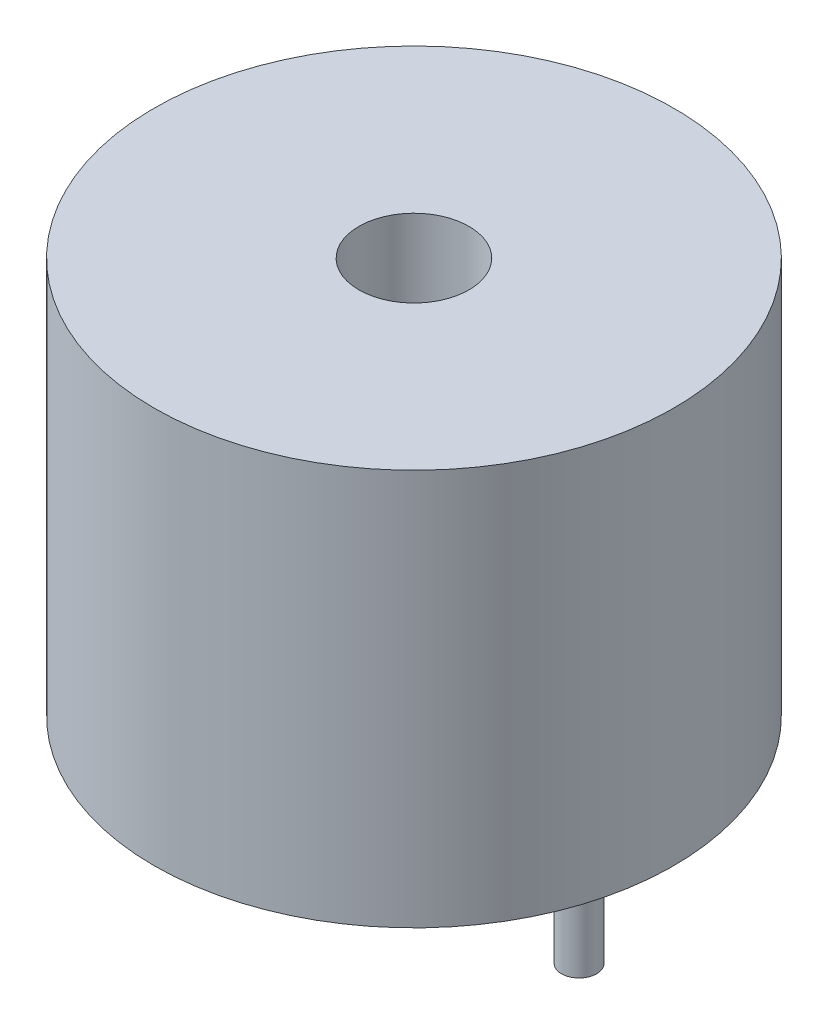
ISO-10303-21;
HEADER;
FILE_DESCRIPTION(('STEP AP214'),'2;1');
FILE_NAME('part.step','',(''),(''),'','','');
FILE_SCHEMA(('AUTOMOTIVE_DESIGN { 1 0 10303 214 1 1 1 1 }'));
ENDSEC;
DATA;
#1=APPLICATION_CONTEXT('core data for automotive mechanical design processes');
#2=APPLICATION_PROTOCOL_DEFINITION('international standard','automotive_design',2000,#1);
#3=PRODUCT_CONTEXT('',#1,'mechanical');
#4=PRODUCT('Part','Part','',(#3));
#5=PRODUCT_RELATED_PRODUCT_CATEGORY('part','',(#4));
#6=PRODUCT_DEFINITION_FORMATION('','',#4);
#7=PRODUCT_DEFINITION_CONTEXT('part definition',#1,'design');
#8=PRODUCT_DEFINITION('design','',#6,#7);
#9=PRODUCT_DEFINITION_SHAPE('','',#8);
#10=(LENGTH_UNIT() NAMED_UNIT(*) SI_UNIT(.MILLI.,.METRE.));
#11=(NAMED_UNIT(*) PLANE_ANGLE_UNIT() SI_UNIT($,.RADIAN.));
#12=(NAMED_UNIT(*) SI_UNIT($,.STERADIAN.) SOLID_ANGLE_UNIT());
#13=UNCERTAINTY_MEASURE_WITH_UNIT(LENGTH_MEASURE(1.E-05),#10,'distance_accuracy_value','');
#14=(GEOMETRIC_REPRESENTATION_CONTEXT(3) GLOBAL_UNCERTAINTY_ASSIGNED_CONTEXT((#13)) GLOBAL_UNIT_ASSIGNED_CONTEXT((#10,
#11,#12)) REPRESENTATION_CONTEXT('',''));
#15=CARTESIAN_POINT('',(0.,0.,0.));
#16=DIRECTION('',(0.,0.,1.));
#17=DIRECTION('',(1.,0.,0.));
#18=AXIS2_PLACEMENT_3D('',#15,#16,#17);
#19=CARTESIAN_POINT('',(0.,9.,0.));
#20=DIRECTION('',(0.,-1.,0.));
#21=DIRECTION('',(0.,0.,-1.));
#22=AXIS2_PLACEMENT_3D('',#19,#20,#21);
#23=CYLINDRICAL_SURFACE('',#22,5.9);
#24=CARTESIAN_POINT('',(0.,9.,0.));
#25=DIRECTION('',(0.,1.,0.));
#26=DIRECTION('',(0.,0.,1.));
#27=AXIS2_PLACEMENT_3D('',#24,#25,#26);
#28=CIRCLE('',#27,5.9);
#29=CARTESIAN_POINT('',(0.,9.,5.9));
#30=VERTEX_POINT('',#29);
#31=EDGE_CURVE('E44',#30,#30,#28,.T.);
#32=ORIENTED_EDGE('',*,*,#31,.F.);
#33=EDGE_LOOP('',(#32));
#34=FACE_BOUND('',#33,.T.);
#35=CARTESIAN_POINT('',(0.,0.,0.));
#36=DIRECTION('',(0.,1.,0.));
#37=DIRECTION('',(0.,0.,1.));
#38=AXIS2_PLACEMENT_3D('',#35,#36,#37);
#39=CIRCLE('',#38,5.9);
#40=CARTESIAN_POINT('',(0.,0.,5.9));
#41=VERTEX_POINT('',#40);
#42=EDGE_CURVE('E48',#41,#41,#39,.T.);
#43=ORIENTED_EDGE('',*,*,#42,.T.);
#44=EDGE_LOOP('',(#43));
#45=FACE_BOUND('',#44,.T.);
#46=ADVANCED_FACE('F34',(#34,#45),#23,.T.);
#47=CARTESIAN_POINT('',(0.,9.,0.));
#48=DIRECTION('',(0.,1.,0.));
#49=DIRECTION('',(0.,0.,1.));
#50=AXIS2_PLACEMENT_3D('',#47,#48,#49);
#51=PLANE('',#50);
#52=CARTESIAN_POINT('',(0.,9.,0.));
#53=DIRECTION('',(0.,1.,0.));
#54=DIRECTION('',(0.,0.,1.));
#55=AXIS2_PLACEMENT_3D('',#52,#53,#54);
#56=CIRCLE('',#55,1.25);
#57=CARTESIAN_POINT('',(0.,9.,1.25));
#58=VERTEX_POINT('',#57);
#59=EDGE_CURVE('E54',#58,#58,#56,.T.);
#60=ORIENTED_EDGE('',*,*,#59,.F.);
#61=EDGE_LOOP('',(#60));
#62=FACE_BOUND('',#61,.T.);
#63=ORIENTED_EDGE('',*,*,#31,.T.);
#64=EDGE_LOOP('',(#63));
#65=FACE_BOUND('',#64,.T.);
#66=ADVANCED_FACE('F81',(#62,#65),#51,.T.);
#67=CARTESIAN_POINT('',(0.,0.,0.));
#68=DIRECTION('',(0.,1.,0.));
#69=DIRECTION('',(0.,0.,1.));
#70=AXIS2_PLACEMENT_3D('',#67,#68,#69);
#71=PLANE('',#70);
#72=CARTESIAN_POINT('',(-3.75,0.,0.));
#73=DIRECTION('',(0.,1.,0.));
#74=DIRECTION('',(0.,0.,1.));
#75=AXIS2_PLACEMENT_3D('',#72,#73,#74);
#76=CIRCLE('',#75,0.4);
#77=CARTESIAN_POINT('',(-3.75,0.,0.4));
#78=VERTEX_POINT('',#77);
#79=EDGE_CURVE('E10',#78,#78,#76,.F.);
#80=ORIENTED_EDGE('',*,*,#79,.F.);
#81=EDGE_LOOP('',(#80));
#82=FACE_BOUND('',#81,.T.);
#83=CARTESIAN_POINT('',(3.75,0.,0.));
#84=DIRECTION('',(0.,1.,0.));
#85=DIRECTION('',(0.,0.,1.));
#86=AXIS2_PLACEMENT_3D('',#83,#84,#85);
#87=CIRCLE('',#86,0.4);
#88=CARTESIAN_POINT('',(3.75,0.,0.400000000000002));
#89=VERTEX_POINT('',#88);
#90=EDGE_CURVE('E40',#89,#89,#87,.F.);
#91=ORIENTED_EDGE('',*,*,#90,.F.);
#92=EDGE_LOOP('',(#91));
#93=FACE_BOUND('',#92,.T.);
#94=ORIENTED_EDGE('',*,*,#42,.F.);
#95=EDGE_LOOP('',(#94));
#96=FACE_BOUND('',#95,.T.);
#97=ADVANCED_FACE('F86',(#82,#93,#96),#71,.F.);
#98=CARTESIAN_POINT('',(0.,6.,0.));
#99=DIRECTION('',(0.,1.,0.));
#100=DIRECTION('',(0.,0.,1.));
#101=AXIS2_PLACEMENT_3D('',#98,#99,#100);
#102=CYLINDRICAL_SURFACE('',#101,1.25);
#103=CARTESIAN_POINT('',(0.,6.,0.));
#104=DIRECTION('',(0.,1.,0.));
#105=DIRECTION('',(0.,0.,1.));
#106=AXIS2_PLACEMENT_3D('',#103,#104,#105);
#107=CIRCLE('',#106,1.25);
#108=CARTESIAN_POINT('',(0.,6.,1.25));
#109=VERTEX_POINT('',#108);
#110=EDGE_CURVE('E52',#109,#109,#107,.T.);
#111=ORIENTED_EDGE('',*,*,#110,.F.);
#112=EDGE_LOOP('',(#111));
#113=FACE_BOUND('',#112,.T.);
#114=ORIENTED_EDGE('',*,*,#59,.T.);
#115=EDGE_LOOP('',(#114));
#116=FACE_BOUND('',#115,.T.);
#117=ADVANCED_FACE('F94',(#113,#116),#102,.F.);
#118=CARTESIAN_POINT('',(0.,6.,0.));
#119=DIRECTION('',(0.,1.,0.));
#120=DIRECTION('',(0.,0.,1.));
#121=AXIS2_PLACEMENT_3D('',#118,#119,#120);
#122=PLANE('',#121);
#123=ORIENTED_EDGE('',*,*,#110,.T.);
#124=EDGE_LOOP('',(#123));
#125=FACE_BOUND('',#124,.T.);
#126=ADVANCED_FACE('F99',(#125),#122,.T.);
#127=CARTESIAN_POINT('',(3.75,-3.,0.));
#128=DIRECTION('',(0.,1.,0.));
#129=DIRECTION('',(0.,0.,1.));
#130=AXIS2_PLACEMENT_3D('',#127,#128,#129);
#131=CYLINDRICAL_SURFACE('',#130,0.4);
#132=CARTESIAN_POINT('',(3.75,-3.,0.));
#133=DIRECTION('',(0.,-1.,0.));
#134=DIRECTION('',(0.,0.,-1.));
#135=AXIS2_PLACEMENT_3D('',#132,#133,#134);
#136=CIRCLE('',#135,0.4);
#137=CARTESIAN_POINT('',(3.75,-3.,-0.399999999999999));
#138=VERTEX_POINT('',#137);
#139=EDGE_CURVE('E57',#138,#138,#136,.T.);
#140=ORIENTED_EDGE('',*,*,#139,.F.);
#141=EDGE_LOOP('',(#140));
#142=FACE_BOUND('',#141,.T.);
#143=ORIENTED_EDGE('',*,*,#90,.T.);
#144=EDGE_LOOP('',(#143));
#145=FACE_BOUND('',#144,.T.);
#146=ADVANCED_FACE('F77',(#142,#145),#131,.T.);
#147=CARTESIAN_POINT('',(3.75,-3.,0.));
#148=DIRECTION('',(0.,-1.,0.));
#149=DIRECTION('',(0.,0.,-1.));
#150=AXIS2_PLACEMENT_3D('',#147,#148,#149);
#151=PLANE('',#150);
#152=ORIENTED_EDGE('',*,*,#139,.T.);
#153=EDGE_LOOP('',(#152));
#154=FACE_BOUND('',#153,.T.);
#155=ADVANCED_FACE('F70',(#154),#151,.T.);
#156=CARTESIAN_POINT('',(-3.75,-3.,0.));
#157=DIRECTION('',(0.,1.,0.));
#158=DIRECTION('',(0.,0.,1.));
#159=AXIS2_PLACEMENT_3D('',#156,#157,#158);
#160=CYLINDRICAL_SURFACE('',#159,0.4);
#161=CARTESIAN_POINT('',(-3.75,-3.,0.));
#162=DIRECTION('',(0.,-1.,0.));
#163=DIRECTION('',(0.,0.,-1.));
#164=AXIS2_PLACEMENT_3D('',#161,#162,#163);
#165=CIRCLE('',#164,0.4);
#166=CARTESIAN_POINT('',(-3.75,-3.,-0.4));
#167=VERTEX_POINT('',#166);
#168=EDGE_CURVE('E62',#167,#167,#165,.T.);
#169=ORIENTED_EDGE('',*,*,#168,.F.);
#170=EDGE_LOOP('',(#169));
#171=FACE_BOUND('',#170,.T.);
#172=ORIENTED_EDGE('',*,*,#79,.T.);
#173=EDGE_LOOP('',(#172));
#174=FACE_BOUND('',#173,.T.);
#175=ADVANCED_FACE('F68',(#171,#174),#160,.T.);
#176=CARTESIAN_POINT('',(-3.75,-3.,0.));
#177=DIRECTION('',(0.,-1.,0.));
#178=DIRECTION('',(0.,0.,-1.));
#179=AXIS2_PLACEMENT_3D('',#176,#177,#178);
#180=PLANE('',#179);
#181=ORIENTED_EDGE('',*,*,#168,.T.);
#182=EDGE_LOOP('',(#181));
#183=FACE_BOUND('',#182,.T.);
#184=ADVANCED_FACE('F66',(#183),#180,.T.);
#185=CLOSED_SHELL('',(#46,#66,#97,#117,#126,#146,#155,#175,#184));
#186=MANIFOLD_SOLID_BREP('B2',#185);
#187=ADVANCED_BREP_SHAPE_REPRESENTATION('',(#18,#186),#14);
#188=SHAPE_DEFINITION_REPRESENTATION(#9,#187);
ENDSEC;
END-ISO-10303-21;
